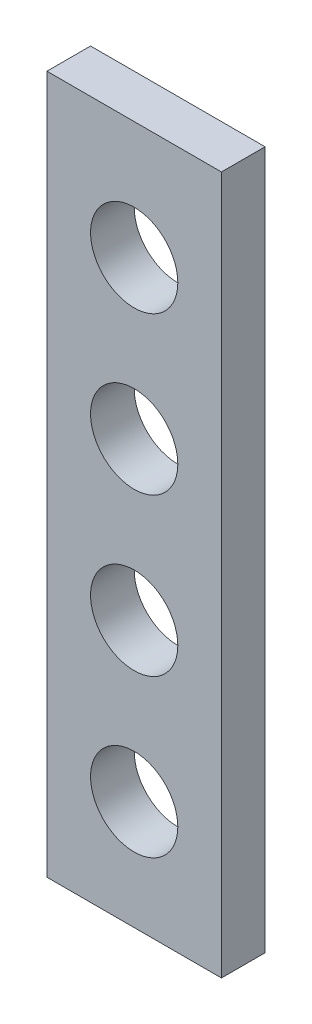
ISO-10303-21;
HEADER;
FILE_DESCRIPTION(('STEP AP214'),'2;1');
FILE_NAME('part.step','',(''),(''),'','','');
FILE_SCHEMA(('AUTOMOTIVE_DESIGN { 1 0 10303 214 1 1 1 1 }'));
ENDSEC;
DATA;
#1=APPLICATION_CONTEXT('core data for automotive mechanical design processes');
#2=APPLICATION_PROTOCOL_DEFINITION('international standard','automotive_design',2000,#1);
#3=PRODUCT_CONTEXT('',#1,'mechanical');
#4=PRODUCT('Part','Part','',(#3));
#5=PRODUCT_RELATED_PRODUCT_CATEGORY('part','',(#4));
#6=PRODUCT_DEFINITION_FORMATION('','',#4);
#7=PRODUCT_DEFINITION_CONTEXT('part definition',#1,'design');
#8=PRODUCT_DEFINITION('design','',#6,#7);
#9=PRODUCT_DEFINITION_SHAPE('','',#8);
#10=(LENGTH_UNIT() NAMED_UNIT(*) SI_UNIT(.MILLI.,.METRE.));
#11=(NAMED_UNIT(*) PLANE_ANGLE_UNIT() SI_UNIT($,.RADIAN.));
#12=(NAMED_UNIT(*) SI_UNIT($,.STERADIAN.) SOLID_ANGLE_UNIT());
#13=UNCERTAINTY_MEASURE_WITH_UNIT(LENGTH_MEASURE(1.E-05),#10,'distance_accuracy_value','');
#14=(GEOMETRIC_REPRESENTATION_CONTEXT(3) GLOBAL_UNCERTAINTY_ASSIGNED_CONTEXT((#13)) GLOBAL_UNIT_ASSIGNED_CONTEXT((#10,
#11,#12)) REPRESENTATION_CONTEXT('',''));
#15=CARTESIAN_POINT('',(0.,0.,0.));
#16=DIRECTION('',(0.,0.,1.));
#17=DIRECTION('',(1.,0.,0.));
#18=AXIS2_PLACEMENT_3D('',#15,#16,#17);
#19=CARTESIAN_POINT('',(-128.294392523364,183.116822429906,0.));
#20=DIRECTION('',(0.,0.,1.));
#21=DIRECTION('',(1.,0.,0.));
#22=AXIS2_PLACEMENT_3D('',#19,#20,#21);
#23=CYLINDRICAL_SURFACE('',#22,10.);
#24=CARTESIAN_POINT('',(-128.294392523364,183.116822429906,0.));
#25=DIRECTION('',(0.,0.,1.));
#26=DIRECTION('',(1.,0.,0.));
#27=AXIS2_PLACEMENT_3D('',#24,#25,#26);
#28=CIRCLE('',#27,10.);
#29=CARTESIAN_POINT('',(-118.294392523364,183.116822429906,0.));
#30=VERTEX_POINT('',#29);
#31=EDGE_CURVE('E45',#30,#30,#28,.T.);
#32=ORIENTED_EDGE('',*,*,#31,.F.);
#33=EDGE_LOOP('',(#32));
#34=FACE_BOUND('',#33,.T.);
#35=CARTESIAN_POINT('',(-128.294392523364,183.116822429906,10.));
#36=DIRECTION('',(0.,0.,1.));
#37=DIRECTION('',(1.,0.,0.));
#38=AXIS2_PLACEMENT_3D('',#35,#36,#37);
#39=CIRCLE('',#38,10.);
#40=CARTESIAN_POINT('',(-118.294392523364,183.116822429906,10.));
#41=VERTEX_POINT('',#40);
#42=EDGE_CURVE('E11',#41,#41,#39,.T.);
#43=ORIENTED_EDGE('',*,*,#42,.T.);
#44=EDGE_LOOP('',(#43));
#45=FACE_BOUND('',#44,.T.);
#46=ADVANCED_FACE('F37',(#34,#45),#23,.F.);
#47=CARTESIAN_POINT('',(-128.294392523364,147.116822429907,0.));
#48=DIRECTION('',(0.,0.,1.));
#49=DIRECTION('',(1.,0.,0.));
#50=AXIS2_PLACEMENT_3D('',#47,#48,#49);
#51=CYLINDRICAL_SURFACE('',#50,10.);
#52=CARTESIAN_POINT('',(-128.294392523364,147.116822429907,0.));
#53=DIRECTION('',(0.,0.,1.));
#54=DIRECTION('',(1.,0.,0.));
#55=AXIS2_PLACEMENT_3D('',#52,#53,#54);
#56=CIRCLE('',#55,10.);
#57=CARTESIAN_POINT('',(-118.294392523364,147.116822429907,0.));
#58=VERTEX_POINT('',#57);
#59=EDGE_CURVE('E115',#58,#58,#56,.T.);
#60=ORIENTED_EDGE('',*,*,#59,.F.);
#61=EDGE_LOOP('',(#60));
#62=FACE_BOUND('',#61,.T.);
#63=CARTESIAN_POINT('',(-128.294392523364,147.116822429907,10.));
#64=DIRECTION('',(0.,0.,1.));
#65=DIRECTION('',(1.,0.,0.));
#66=AXIS2_PLACEMENT_3D('',#63,#64,#65);
#67=CIRCLE('',#66,10.);
#68=CARTESIAN_POINT('',(-118.294392523364,147.116822429907,10.));
#69=VERTEX_POINT('',#68);
#70=EDGE_CURVE('E118',#69,#69,#67,.T.);
#71=ORIENTED_EDGE('',*,*,#70,.T.);
#72=EDGE_LOOP('',(#71));
#73=FACE_BOUND('',#72,.T.);
#74=ADVANCED_FACE('F127',(#62,#73),#51,.F.);
#75=CARTESIAN_POINT('',(-148.294392523364,50.1168224299065,10.));
#76=DIRECTION('',(1.,0.,0.));
#77=DIRECTION('',(0.,0.,-1.));
#78=AXIS2_PLACEMENT_3D('',#75,#76,#77);
#79=PLANE('',#78);
#80=DIRECTION('',(0.,-1.,0.));
#81=VECTOR('',#80,1.);
#82=CARTESIAN_POINT('',(-148.294392523364,50.1168224299065,0.));
#83=LINE('',#82,#81);
#84=CARTESIAN_POINT('',(-148.294392523364,210.116822429907,0.));
#85=VERTEX_POINT('',#84);
#86=CARTESIAN_POINT('',(-148.294392523364,50.1168224299065,0.));
#87=VERTEX_POINT('',#86);
#88=EDGE_CURVE('E105',#85,#87,#83,.T.);
#89=ORIENTED_EDGE('',*,*,#88,.T.);
#90=DIRECTION('',(0.,0.,-1.));
#91=VECTOR('',#90,1.);
#92=CARTESIAN_POINT('',(-148.294392523364,50.1168224299065,10.));
#93=LINE('',#92,#91);
#94=CARTESIAN_POINT('',(-148.294392523364,50.1168224299065,10.));
#95=VERTEX_POINT('',#94);
#96=EDGE_CURVE('E96',#95,#87,#93,.T.);
#97=ORIENTED_EDGE('',*,*,#96,.F.);
#98=DIRECTION('',(0.,-1.,0.));
#99=VECTOR('',#98,1.);
#100=CARTESIAN_POINT('',(-148.294392523364,50.1168224299065,10.));
#101=LINE('',#100,#99);
#102=CARTESIAN_POINT('',(-148.294392523364,210.116822429907,10.));
#103=VERTEX_POINT('',#102);
#104=EDGE_CURVE('E90',#103,#95,#101,.T.);
#105=ORIENTED_EDGE('',*,*,#104,.F.);
#106=DIRECTION('',(0.,0.,-1.));
#107=VECTOR('',#106,1.);
#108=CARTESIAN_POINT('',(-148.294392523364,210.116822429907,10.));
#109=LINE('',#108,#107);
#110=EDGE_CURVE('E101',#103,#85,#109,.T.);
#111=ORIENTED_EDGE('',*,*,#110,.T.);
#112=EDGE_LOOP('',(#89,#97,#105,#111));
#113=FACE_BOUND('',#112,.T.);
#114=ADVANCED_FACE('F151',(#113),#79,.F.);
#115=CARTESIAN_POINT('',(-148.294392523364,50.1168224299065,10.));
#116=DIRECTION('',(0.,1.,0.));
#117=DIRECTION('',(0.,0.,1.));
#118=AXIS2_PLACEMENT_3D('',#115,#116,#117);
#119=PLANE('',#118);
#120=DIRECTION('',(1.,0.,0.));
#121=VECTOR('',#120,1.);
#122=CARTESIAN_POINT('',(-148.294392523364,50.1168224299065,0.));
#123=LINE('',#122,#121);
#124=CARTESIAN_POINT('',(-108.294392523364,50.1168224299065,0.));
#125=VERTEX_POINT('',#124);
#126=EDGE_CURVE('E95',#87,#125,#123,.T.);
#127=ORIENTED_EDGE('',*,*,#126,.T.);
#128=DIRECTION('',(0.,0.,-1.));
#129=VECTOR('',#128,1.);
#130=CARTESIAN_POINT('',(-108.294392523364,50.1168224299065,10.));
#131=LINE('',#130,#129);
#132=CARTESIAN_POINT('',(-108.294392523364,50.1168224299065,10.));
#133=VERTEX_POINT('',#132);
#134=EDGE_CURVE('E93',#133,#125,#131,.T.);
#135=ORIENTED_EDGE('',*,*,#134,.F.);
#136=DIRECTION('',(1.,0.,0.));
#137=VECTOR('',#136,1.);
#138=CARTESIAN_POINT('',(-148.294392523364,50.1168224299065,10.));
#139=LINE('',#138,#137);
#140=EDGE_CURVE('E84',#95,#133,#139,.T.);
#141=ORIENTED_EDGE('',*,*,#140,.F.);
#142=ORIENTED_EDGE('',*,*,#96,.T.);
#143=EDGE_LOOP('',(#127,#135,#141,#142));
#144=FACE_BOUND('',#143,.T.);
#145=ADVANCED_FACE('F94',(#144),#119,.F.);
#146=CARTESIAN_POINT('',(-108.294392523364,50.1168224299065,10.));
#147=DIRECTION('',(-1.,0.,0.));
#148=DIRECTION('',(0.,0.,1.));
#149=AXIS2_PLACEMENT_3D('',#146,#147,#148);
#150=PLANE('',#149);
#151=DIRECTION('',(0.,1.,0.));
#152=VECTOR('',#151,1.);
#153=CARTESIAN_POINT('',(-108.294392523364,50.1168224299065,0.));
#154=LINE('',#153,#152);
#155=CARTESIAN_POINT('',(-108.294392523364,210.116822429907,0.));
#156=VERTEX_POINT('',#155);
#157=EDGE_CURVE('E70',#125,#156,#154,.T.);
#158=ORIENTED_EDGE('',*,*,#157,.T.);
#159=DIRECTION('',(0.,0.,-1.));
#160=VECTOR('',#159,1.);
#161=CARTESIAN_POINT('',(-108.294392523364,210.116822429907,10.));
#162=LINE('',#161,#160);
#163=CARTESIAN_POINT('',(-108.294392523364,210.116822429907,10.));
#164=VERTEX_POINT('',#163);
#165=EDGE_CURVE('E97',#164,#156,#162,.T.);
#166=ORIENTED_EDGE('',*,*,#165,.F.);
#167=DIRECTION('',(0.,1.,0.));
#168=VECTOR('',#167,1.);
#169=CARTESIAN_POINT('',(-108.294392523364,50.1168224299065,10.));
#170=LINE('',#169,#168);
#171=EDGE_CURVE('E88',#133,#164,#170,.T.);
#172=ORIENTED_EDGE('',*,*,#171,.F.);
#173=ORIENTED_EDGE('',*,*,#134,.T.);
#174=EDGE_LOOP('',(#158,#166,#172,#173));
#175=FACE_BOUND('',#174,.T.);
#176=ADVANCED_FACE('F99',(#175),#150,.F.);
#177=CARTESIAN_POINT('',(-148.294392523364,210.116822429907,10.));
#178=DIRECTION('',(0.,-1.,0.));
#179=DIRECTION('',(0.,0.,-1.));
#180=AXIS2_PLACEMENT_3D('',#177,#178,#179);
#181=PLANE('',#180);
#182=DIRECTION('',(-1.,0.,0.));
#183=VECTOR('',#182,1.);
#184=CARTESIAN_POINT('',(-148.294392523364,210.116822429907,0.));
#185=LINE('',#184,#183);
#186=EDGE_CURVE('E76',#156,#85,#185,.T.);
#187=ORIENTED_EDGE('',*,*,#186,.T.);
#188=ORIENTED_EDGE('',*,*,#110,.F.);
#189=DIRECTION('',(-1.,0.,0.));
#190=VECTOR('',#189,1.);
#191=CARTESIAN_POINT('',(-148.294392523364,210.116822429907,10.));
#192=LINE('',#191,#190);
#193=EDGE_CURVE('E53',#164,#103,#192,.T.);
#194=ORIENTED_EDGE('',*,*,#193,.F.);
#195=ORIENTED_EDGE('',*,*,#165,.T.);
#196=EDGE_LOOP('',(#187,#188,#194,#195));
#197=FACE_BOUND('',#196,.T.);
#198=ADVANCED_FACE('F131',(#197),#181,.F.);
#199=CARTESIAN_POINT('',(0.,0.,10.));
#200=DIRECTION('',(0.,0.,-1.));
#201=DIRECTION('',(-1.,0.,0.));
#202=AXIS2_PLACEMENT_3D('',#199,#200,#201);
#203=PLANE('',#202);
#204=CARTESIAN_POINT('',(-128.294392523364,111.116822429907,10.));
#205=DIRECTION('',(0.,0.,1.));
#206=DIRECTION('',(1.,0.,0.));
#207=AXIS2_PLACEMENT_3D('',#204,#205,#206);
#208=CIRCLE('',#207,10.);
#209=CARTESIAN_POINT('',(-118.294392523364,111.116822429907,10.));
#210=VERTEX_POINT('',#209);
#211=EDGE_CURVE('E248',#210,#210,#208,.T.);
#212=ORIENTED_EDGE('',*,*,#211,.F.);
#213=EDGE_LOOP('',(#212));
#214=FACE_BOUND('',#213,.T.);
#215=CARTESIAN_POINT('',(-128.294392523364,75.1168224299065,10.));
#216=DIRECTION('',(0.,0.,1.));
#217=DIRECTION('',(1.,0.,0.));
#218=AXIS2_PLACEMENT_3D('',#215,#216,#217);
#219=CIRCLE('',#218,10.);
#220=CARTESIAN_POINT('',(-118.294392523364,75.1168224299065,10.));
#221=VERTEX_POINT('',#220);
#222=EDGE_CURVE('E249',#221,#221,#219,.T.);
#223=ORIENTED_EDGE('',*,*,#222,.F.);
#224=EDGE_LOOP('',(#223));
#225=FACE_BOUND('',#224,.T.);
#226=ORIENTED_EDGE('',*,*,#104,.T.);
#227=ORIENTED_EDGE('',*,*,#140,.T.);
#228=ORIENTED_EDGE('',*,*,#171,.T.);
#229=ORIENTED_EDGE('',*,*,#193,.T.);
#230=EDGE_LOOP('',(#226,#227,#228,#229));
#231=FACE_BOUND('',#230,.T.);
#232=ORIENTED_EDGE('',*,*,#70,.F.);
#233=EDGE_LOOP('',(#232));
#234=FACE_BOUND('',#233,.T.);
#235=ORIENTED_EDGE('',*,*,#42,.F.);
#236=EDGE_LOOP('',(#235));
#237=FACE_BOUND('',#236,.T.);
#238=ADVANCED_FACE('F85',(#214,#225,#231,#234,#237),#203,.F.);
#239=CARTESIAN_POINT('',(0.,0.,0.));
#240=DIRECTION('',(0.,0.,-1.));
#241=DIRECTION('',(-1.,0.,0.));
#242=AXIS2_PLACEMENT_3D('',#239,#240,#241);
#243=PLANE('',#242);
#244=CARTESIAN_POINT('',(-128.294392523364,111.116822429907,0.));
#245=DIRECTION('',(0.,0.,1.));
#246=DIRECTION('',(1.,0.,0.));
#247=AXIS2_PLACEMENT_3D('',#244,#245,#246);
#248=CIRCLE('',#247,10.);
#249=CARTESIAN_POINT('',(-118.294392523364,111.116822429907,0.));
#250=VERTEX_POINT('',#249);
#251=EDGE_CURVE('E246',#250,#250,#248,.T.);
#252=ORIENTED_EDGE('',*,*,#251,.T.);
#253=EDGE_LOOP('',(#252));
#254=FACE_BOUND('',#253,.T.);
#255=CARTESIAN_POINT('',(-128.294392523364,75.1168224299065,0.));
#256=DIRECTION('',(0.,0.,1.));
#257=DIRECTION('',(1.,0.,0.));
#258=AXIS2_PLACEMENT_3D('',#255,#256,#257);
#259=CIRCLE('',#258,10.);
#260=CARTESIAN_POINT('',(-118.294392523364,75.1168224299065,0.));
#261=VERTEX_POINT('',#260);
#262=EDGE_CURVE('E108',#261,#261,#259,.T.);
#263=ORIENTED_EDGE('',*,*,#262,.T.);
#264=EDGE_LOOP('',(#263));
#265=FACE_BOUND('',#264,.T.);
#266=ORIENTED_EDGE('',*,*,#88,.F.);
#267=ORIENTED_EDGE('',*,*,#186,.F.);
#268=ORIENTED_EDGE('',*,*,#157,.F.);
#269=ORIENTED_EDGE('',*,*,#126,.F.);
#270=EDGE_LOOP('',(#266,#267,#268,#269));
#271=FACE_BOUND('',#270,.T.);
#272=ORIENTED_EDGE('',*,*,#59,.T.);
#273=EDGE_LOOP('',(#272));
#274=FACE_BOUND('',#273,.T.);
#275=ORIENTED_EDGE('',*,*,#31,.T.);
#276=EDGE_LOOP('',(#275));
#277=FACE_BOUND('',#276,.T.);
#278=ADVANCED_FACE('F123',(#254,#265,#271,#274,#277),#243,.T.);
#279=CARTESIAN_POINT('',(-128.294392523364,75.1168224299065,0.));
#280=DIRECTION('',(0.,0.,1.));
#281=DIRECTION('',(1.,0.,0.));
#282=AXIS2_PLACEMENT_3D('',#279,#280,#281);
#283=CYLINDRICAL_SURFACE('',#282,10.);
#284=ORIENTED_EDGE('',*,*,#262,.F.);
#285=EDGE_LOOP('',(#284));
#286=FACE_BOUND('',#285,.T.);
#287=ORIENTED_EDGE('',*,*,#222,.T.);
#288=EDGE_LOOP('',(#287));
#289=FACE_BOUND('',#288,.T.);
#290=ADVANCED_FACE('F138',(#286,#289),#283,.F.);
#291=CARTESIAN_POINT('',(-128.294392523364,111.116822429907,0.));
#292=DIRECTION('',(0.,0.,1.));
#293=DIRECTION('',(1.,0.,0.));
#294=AXIS2_PLACEMENT_3D('',#291,#292,#293);
#295=CYLINDRICAL_SURFACE('',#294,10.);
#296=ORIENTED_EDGE('',*,*,#251,.F.);
#297=EDGE_LOOP('',(#296));
#298=FACE_BOUND('',#297,.T.);
#299=ORIENTED_EDGE('',*,*,#211,.T.);
#300=EDGE_LOOP('',(#299));
#301=FACE_BOUND('',#300,.T.);
#302=ADVANCED_FACE('F190',(#298,#301),#295,.F.);
#303=CLOSED_SHELL('',(#46,#74,#114,#145,#176,#198,#238,#278,#290,#302));
#304=MANIFOLD_SOLID_BREP('B2',#303);
#305=ADVANCED_BREP_SHAPE_REPRESENTATION('',(#18,#304),#14);
#306=SHAPE_DEFINITION_REPRESENTATION(#9,#305);
ENDSEC;
END-ISO-10303-21;
